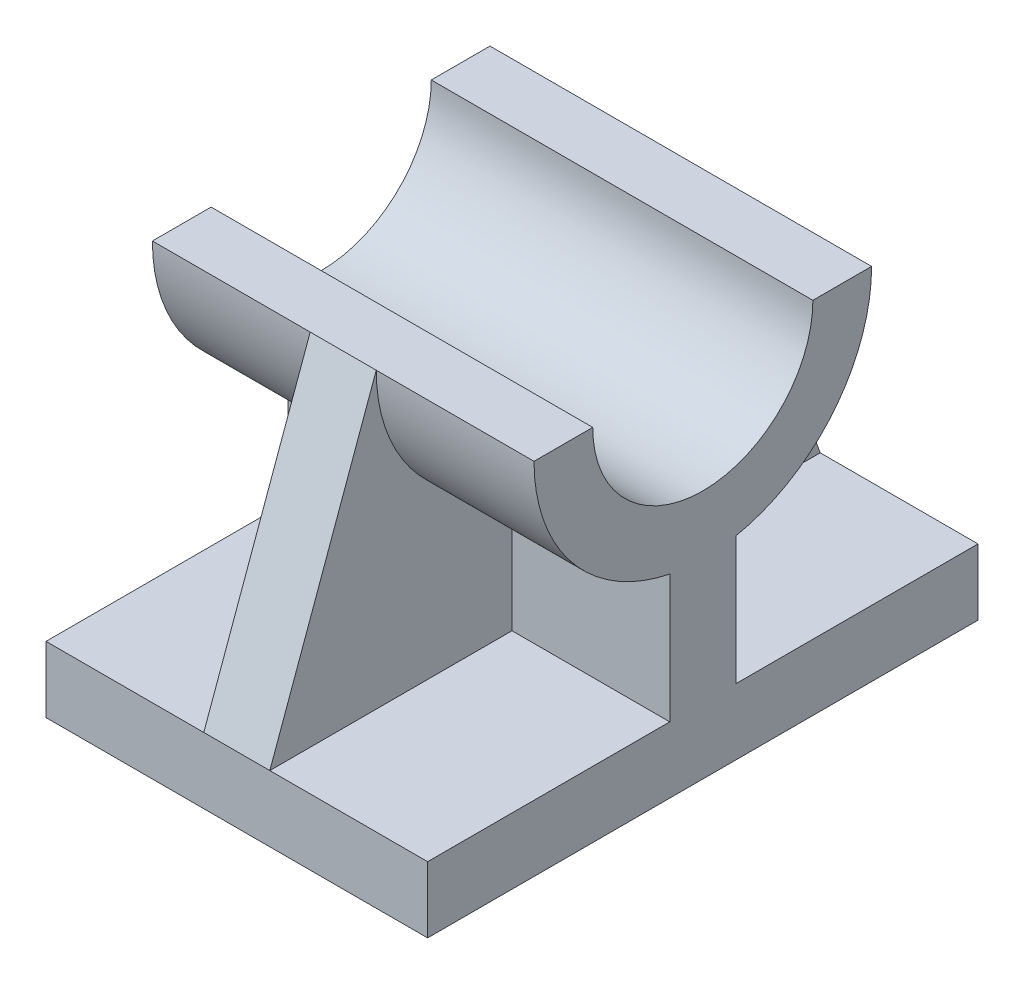
ISO-10303-21;
HEADER;
FILE_DESCRIPTION(('STEP AP214'),'2;1');
FILE_NAME('part.step','',(''),(''),'','','');
FILE_SCHEMA(('AUTOMOTIVE_DESIGN { 1 0 10303 214 1 1 1 1 }'));
ENDSEC;
DATA;
#1=APPLICATION_CONTEXT('core data for automotive mechanical design processes');
#2=APPLICATION_PROTOCOL_DEFINITION('international standard','automotive_design',2000,#1);
#3=PRODUCT_CONTEXT('',#1,'mechanical');
#4=PRODUCT('Part','Part','',(#3));
#5=PRODUCT_RELATED_PRODUCT_CATEGORY('part','',(#4));
#6=PRODUCT_DEFINITION_FORMATION('','',#4);
#7=PRODUCT_DEFINITION_CONTEXT('part definition',#1,'design');
#8=PRODUCT_DEFINITION('design','',#6,#7);
#9=PRODUCT_DEFINITION_SHAPE('','',#8);
#10=(LENGTH_UNIT() NAMED_UNIT(*) SI_UNIT(.MILLI.,.METRE.));
#11=(NAMED_UNIT(*) PLANE_ANGLE_UNIT() SI_UNIT($,.RADIAN.));
#12=(NAMED_UNIT(*) SI_UNIT($,.STERADIAN.) SOLID_ANGLE_UNIT());
#13=UNCERTAINTY_MEASURE_WITH_UNIT(LENGTH_MEASURE(1.E-05),#10,'distance_accuracy_value','');
#14=(GEOMETRIC_REPRESENTATION_CONTEXT(3) GLOBAL_UNCERTAINTY_ASSIGNED_CONTEXT((#13)) GLOBAL_UNIT_ASSIGNED_CONTEXT((#10,
#11,#12)) REPRESENTATION_CONTEXT('',''));
#15=CARTESIAN_POINT('',(0.,0.,0.));
#16=DIRECTION('',(0.,0.,1.));
#17=DIRECTION('',(1.,0.,0.));
#18=AXIS2_PLACEMENT_3D('',#15,#16,#17);
#19=CARTESIAN_POINT('',(26.,44.5,0.));
#20=DIRECTION('',(-1.,0.,0.));
#21=DIRECTION('',(0.,0.,1.));
#22=AXIS2_PLACEMENT_3D('',#19,#20,#21);
#23=CYLINDRICAL_SURFACE('',#22,23.);
#24=CARTESIAN_POINT('',(-4.5,44.5,0.));
#25=DIRECTION('',(1.,0.,0.));
#26=DIRECTION('',(0.,0.,-1.));
#27=AXIS2_PLACEMENT_3D('',#24,#25,#26);
#28=CIRCLE('',#27,23.);
#29=CARTESIAN_POINT('',(-4.5,44.5,23.));
#30=VERTEX_POINT('',#29);
#31=CARTESIAN_POINT('',(-4.5,21.9445128627201,4.5));
#32=VERTEX_POINT('',#31);
#33=EDGE_CURVE('E192',#30,#32,#28,.T.);
#34=ORIENTED_EDGE('',*,*,#33,.F.);
#35=DIRECTION('',(-1.,0.,0.));
#36=VECTOR('',#35,1.);
#37=CARTESIAN_POINT('',(26.,44.5,23.));
#38=LINE('',#37,#36);
#39=CARTESIAN_POINT('',(-26.,44.5,23.));
#40=VERTEX_POINT('',#39);
#41=EDGE_CURVE('E202',#30,#40,#38,.T.);
#42=ORIENTED_EDGE('',*,*,#41,.T.);
#43=CARTESIAN_POINT('',(-26.,44.5,0.));
#44=DIRECTION('',(1.,0.,0.));
#45=DIRECTION('',(0.,0.,-1.));
#46=AXIS2_PLACEMENT_3D('',#43,#44,#45);
#47=CIRCLE('',#46,23.);
#48=CARTESIAN_POINT('',(-26.,21.9445128627201,4.5));
#49=VERTEX_POINT('',#48);
#50=EDGE_CURVE('E276',#40,#49,#47,.T.);
#51=ORIENTED_EDGE('',*,*,#50,.T.);
#52=DIRECTION('',(-1.,0.,0.));
#53=VECTOR('',#52,1.);
#54=CARTESIAN_POINT('',(26.,21.9445128627201,4.5));
#55=LINE('',#54,#53);
#56=EDGE_CURVE('E204',#32,#49,#55,.T.);
#57=ORIENTED_EDGE('',*,*,#56,.F.);
#58=EDGE_LOOP('',(#34,#42,#51,#57));
#59=FACE_BOUND('',#58,.T.);
#60=ADVANCED_FACE('F39',(#59),#23,.T.);
#61=CARTESIAN_POINT('',(26.,21.9445128627201,4.5));
#62=DIRECTION('',(0.,0.,-1.));
#63=DIRECTION('',(-1.,0.,0.));
#64=AXIS2_PLACEMENT_3D('',#61,#62,#63);
#65=PLANE('',#64);
#66=DIRECTION('',(0.,-1.,0.));
#67=VECTOR('',#66,1.);
#68=CARTESIAN_POINT('',(-4.5,21.9445128627201,4.5));
#69=LINE('',#68,#67);
#70=CARTESIAN_POINT('',(-4.5,4.5,4.5));
#71=VERTEX_POINT('',#70);
#72=EDGE_CURVE('E206',#32,#71,#69,.T.);
#73=ORIENTED_EDGE('',*,*,#72,.F.);
#74=ORIENTED_EDGE('',*,*,#56,.T.);
#75=DIRECTION('',(0.,-1.,0.));
#76=VECTOR('',#75,1.);
#77=CARTESIAN_POINT('',(-26.,21.9445128627201,4.5));
#78=LINE('',#77,#76);
#79=CARTESIAN_POINT('',(-26.,4.5,4.5));
#80=VERTEX_POINT('',#79);
#81=EDGE_CURVE('E279',#49,#80,#78,.T.);
#82=ORIENTED_EDGE('',*,*,#81,.T.);
#83=DIRECTION('',(-1.,0.,0.));
#84=VECTOR('',#83,1.);
#85=CARTESIAN_POINT('',(26.,4.5,4.5));
#86=LINE('',#85,#84);
#87=EDGE_CURVE('E316',#71,#80,#86,.T.);
#88=ORIENTED_EDGE('',*,*,#87,.F.);
#89=EDGE_LOOP('',(#73,#74,#82,#88));
#90=FACE_BOUND('',#89,.T.);
#91=ADVANCED_FACE('F334',(#90),#65,.F.);
#92=CARTESIAN_POINT('',(26.,4.5,37.5));
#93=DIRECTION('',(0.,-1.,0.));
#94=DIRECTION('',(0.,0.,-1.));
#95=AXIS2_PLACEMENT_3D('',#92,#93,#94);
#96=PLANE('',#95);
#97=DIRECTION('',(0.,0.,1.));
#98=VECTOR('',#97,1.);
#99=CARTESIAN_POINT('',(-4.5,4.5,37.5));
#100=LINE('',#99,#98);
#101=CARTESIAN_POINT('',(-4.49999999999999,4.5,37.5));
#102=VERTEX_POINT('',#101);
#103=EDGE_CURVE('E195',#71,#102,#100,.T.);
#104=ORIENTED_EDGE('',*,*,#103,.F.);
#105=ORIENTED_EDGE('',*,*,#87,.T.);
#106=DIRECTION('',(0.,0.,1.));
#107=VECTOR('',#106,1.);
#108=CARTESIAN_POINT('',(-26.,4.5,37.5));
#109=LINE('',#108,#107);
#110=CARTESIAN_POINT('',(-26.,4.5,37.5));
#111=VERTEX_POINT('',#110);
#112=EDGE_CURVE('E283',#80,#111,#109,.T.);
#113=ORIENTED_EDGE('',*,*,#112,.T.);
#114=DIRECTION('',(-1.,0.,0.));
#115=VECTOR('',#114,1.);
#116=CARTESIAN_POINT('',(26.,4.5,37.5));
#117=LINE('',#116,#115);
#118=EDGE_CURVE('E312',#102,#111,#117,.T.);
#119=ORIENTED_EDGE('',*,*,#118,.F.);
#120=EDGE_LOOP('',(#104,#105,#113,#119));
#121=FACE_BOUND('',#120,.T.);
#122=ADVANCED_FACE('F329',(#121),#96,.F.);
#123=CARTESIAN_POINT('',(26.,4.5,-4.5));
#124=DIRECTION('',(0.,-1.,0.));
#125=DIRECTION('',(0.,0.,-1.));
#126=AXIS2_PLACEMENT_3D('',#123,#124,#125);
#127=PLANE('',#126);
#128=DIRECTION('',(0.,0.,1.));
#129=VECTOR('',#128,1.);
#130=CARTESIAN_POINT('',(-4.5,4.5,-4.5));
#131=LINE('',#130,#129);
#132=CARTESIAN_POINT('',(-4.5,4.5,-37.5));
#133=VERTEX_POINT('',#132);
#134=CARTESIAN_POINT('',(-4.49999999999999,4.5,-4.5));
#135=VERTEX_POINT('',#134);
#136=EDGE_CURVE('E410',#133,#135,#131,.T.);
#137=ORIENTED_EDGE('',*,*,#136,.F.);
#138=DIRECTION('',(-1.,0.,0.));
#139=VECTOR('',#138,1.);
#140=CARTESIAN_POINT('',(26.,4.5,-37.5));
#141=LINE('',#140,#139);
#142=CARTESIAN_POINT('',(-26.,4.5,-37.5));
#143=VERTEX_POINT('',#142);
#144=EDGE_CURVE('E306',#133,#143,#141,.T.);
#145=ORIENTED_EDGE('',*,*,#144,.T.);
#146=DIRECTION('',(0.,0.,1.));
#147=VECTOR('',#146,1.);
#148=CARTESIAN_POINT('',(-26.,4.5,-4.5));
#149=LINE('',#148,#147);
#150=CARTESIAN_POINT('',(-26.,4.5,-4.5));
#151=VERTEX_POINT('',#150);
#152=EDGE_CURVE('E258',#143,#151,#149,.T.);
#153=ORIENTED_EDGE('',*,*,#152,.T.);
#154=DIRECTION('',(-1.,0.,0.));
#155=VECTOR('',#154,1.);
#156=CARTESIAN_POINT('',(26.,4.5,-4.5));
#157=LINE('',#156,#155);
#158=EDGE_CURVE('E48',#135,#151,#157,.T.);
#159=ORIENTED_EDGE('',*,*,#158,.F.);
#160=EDGE_LOOP('',(#137,#145,#153,#159));
#161=FACE_BOUND('',#160,.T.);
#162=ADVANCED_FACE('F517',(#161),#127,.F.);
#163=CARTESIAN_POINT('',(26.,21.9445128627201,-4.5));
#164=DIRECTION('',(0.,0.,1.));
#165=DIRECTION('',(0.,-1.,0.));
#166=AXIS2_PLACEMENT_3D('',#163,#164,#165);
#167=PLANE('',#166);
#168=DIRECTION('',(0.,1.,0.));
#169=VECTOR('',#168,1.);
#170=CARTESIAN_POINT('',(-4.5,21.9445128627201,-4.5));
#171=LINE('',#170,#169);
#172=CARTESIAN_POINT('',(-4.49999999999999,21.9445128627201,-4.49999999999999));
#173=VERTEX_POINT('',#172);
#174=EDGE_CURVE('E63',#135,#173,#171,.T.);
#175=ORIENTED_EDGE('',*,*,#174,.F.);
#176=ORIENTED_EDGE('',*,*,#158,.T.);
#177=DIRECTION('',(0.,1.,0.));
#178=VECTOR('',#177,1.);
#179=CARTESIAN_POINT('',(-26.,21.9445128627201,-4.5));
#180=LINE('',#179,#178);
#181=CARTESIAN_POINT('',(-26.,21.9445128627201,-4.49999999999999));
#182=VERTEX_POINT('',#181);
#183=EDGE_CURVE('E252',#151,#182,#180,.T.);
#184=ORIENTED_EDGE('',*,*,#183,.T.);
#185=DIRECTION('',(-1.,0.,0.));
#186=VECTOR('',#185,1.);
#187=CARTESIAN_POINT('',(26.,21.9445128627201,-4.49999999999999));
#188=LINE('',#187,#186);
#189=EDGE_CURVE('E232',#173,#182,#188,.T.);
#190=ORIENTED_EDGE('',*,*,#189,.F.);
#191=EDGE_LOOP('',(#175,#176,#184,#190));
#192=FACE_BOUND('',#191,.T.);
#193=ADVANCED_FACE('F253',(#192),#167,.F.);
#194=CARTESIAN_POINT('',(26.,44.5,0.));
#195=DIRECTION('',(-1.,0.,0.));
#196=DIRECTION('',(0.,0.,1.));
#197=AXIS2_PLACEMENT_3D('',#194,#195,#196);
#198=CYLINDRICAL_SURFACE('',#197,23.);
#199=CARTESIAN_POINT('',(-4.5,44.5,0.));
#200=DIRECTION('',(1.,0.,0.));
#201=DIRECTION('',(0.,0.,-1.));
#202=AXIS2_PLACEMENT_3D('',#199,#200,#201);
#203=CIRCLE('',#202,23.);
#204=CARTESIAN_POINT('',(-4.49999999999999,44.5,-23.));
#205=VERTEX_POINT('',#204);
#206=EDGE_CURVE('E250',#173,#205,#203,.T.);
#207=ORIENTED_EDGE('',*,*,#206,.F.);
#208=ORIENTED_EDGE('',*,*,#189,.T.);
#209=CARTESIAN_POINT('',(-26.,44.5,0.));
#210=DIRECTION('',(1.,0.,0.));
#211=DIRECTION('',(0.,0.,-1.));
#212=AXIS2_PLACEMENT_3D('',#209,#210,#211);
#213=CIRCLE('',#212,23.);
#214=CARTESIAN_POINT('',(-26.,44.5,-23.));
#215=VERTEX_POINT('',#214);
#216=EDGE_CURVE('E247',#182,#215,#213,.T.);
#217=ORIENTED_EDGE('',*,*,#216,.T.);
#218=DIRECTION('',(-1.,0.,0.));
#219=VECTOR('',#218,1.);
#220=CARTESIAN_POINT('',(26.,44.5,-23.));
#221=LINE('',#220,#219);
#222=EDGE_CURVE('E228',#205,#215,#221,.T.);
#223=ORIENTED_EDGE('',*,*,#222,.F.);
#224=EDGE_LOOP('',(#207,#208,#217,#223));
#225=FACE_BOUND('',#224,.T.);
#226=ADVANCED_FACE('F245',(#225),#198,.T.);
#227=CARTESIAN_POINT('',(26.,4.5,-37.5));
#228=VERTEX_POINT('',#227);
#229=CARTESIAN_POINT('',(4.50000000000001,4.5,-37.5));
#230=VERTEX_POINT('',#229);
#231=EDGE_CURVE('E300',#228,#230,#141,.T.);
#232=ORIENTED_EDGE('',*,*,#231,.T.);
#233=DIRECTION('',(0.,0.,1.));
#234=VECTOR('',#233,1.);
#235=CARTESIAN_POINT('',(4.5,4.5,-4.5));
#236=LINE('',#235,#234);
#237=CARTESIAN_POINT('',(4.50000000000001,4.5,-4.5));
#238=VERTEX_POINT('',#237);
#239=EDGE_CURVE('E394',#230,#238,#236,.T.);
#240=ORIENTED_EDGE('',*,*,#239,.T.);
#241=CARTESIAN_POINT('',(26.,4.5,-4.5));
#242=VERTEX_POINT('',#241);
#243=EDGE_CURVE('E11',#242,#238,#157,.T.);
#244=ORIENTED_EDGE('',*,*,#243,.F.);
#245=DIRECTION('',(0.,0.,1.));
#246=VECTOR('',#245,1.);
#247=CARTESIAN_POINT('',(26.,4.5,-4.5));
#248=LINE('',#247,#246);
#249=EDGE_CURVE('E299',#228,#242,#248,.T.);
#250=ORIENTED_EDGE('',*,*,#249,.F.);
#251=EDGE_LOOP('',(#232,#240,#244,#250));
#252=FACE_BOUND('',#251,.T.);
#253=ADVANCED_FACE('F41',(#252),#127,.F.);
#254=ORIENTED_EDGE('',*,*,#243,.T.);
#255=DIRECTION('',(0.,1.,0.));
#256=VECTOR('',#255,1.);
#257=CARTESIAN_POINT('',(4.5,21.9445128627201,-4.5));
#258=LINE('',#257,#256);
#259=CARTESIAN_POINT('',(4.50000000000001,21.9445128627201,-4.49999999999999));
#260=VERTEX_POINT('',#259);
#261=EDGE_CURVE('E401',#238,#260,#258,.T.);
#262=ORIENTED_EDGE('',*,*,#261,.T.);
#263=CARTESIAN_POINT('',(26.,21.9445128627201,-4.49999999999999));
#264=VERTEX_POINT('',#263);
#265=EDGE_CURVE('E233',#264,#260,#188,.T.);
#266=ORIENTED_EDGE('',*,*,#265,.F.);
#267=DIRECTION('',(0.,1.,0.));
#268=VECTOR('',#267,1.);
#269=CARTESIAN_POINT('',(26.,21.9445128627201,-4.5));
#270=LINE('',#269,#268);
#271=EDGE_CURVE('E378',#242,#264,#270,.T.);
#272=ORIENTED_EDGE('',*,*,#271,.F.);
#273=EDGE_LOOP('',(#254,#262,#266,#272));
#274=FACE_BOUND('',#273,.T.);
#275=ADVANCED_FACE('F475',(#274),#167,.F.);
#276=ORIENTED_EDGE('',*,*,#265,.T.);
#277=CARTESIAN_POINT('',(4.5,44.5,0.));
#278=DIRECTION('',(1.,0.,0.));
#279=DIRECTION('',(0.,0.,-1.));
#280=AXIS2_PLACEMENT_3D('',#277,#278,#279);
#281=CIRCLE('',#280,23.);
#282=CARTESIAN_POINT('',(4.50000000000001,44.5,-23.));
#283=VERTEX_POINT('',#282);
#284=EDGE_CURVE('E405',#260,#283,#281,.T.);
#285=ORIENTED_EDGE('',*,*,#284,.T.);
#286=CARTESIAN_POINT('',(26.,44.5,-23.));
#287=VERTEX_POINT('',#286);
#288=EDGE_CURVE('E229',#287,#283,#221,.T.);
#289=ORIENTED_EDGE('',*,*,#288,.F.);
#290=CARTESIAN_POINT('',(26.,44.5,0.));
#291=DIRECTION('',(1.,0.,0.));
#292=DIRECTION('',(0.,0.,-1.));
#293=AXIS2_PLACEMENT_3D('',#290,#291,#292);
#294=CIRCLE('',#293,23.);
#295=EDGE_CURVE('E375',#264,#287,#294,.T.);
#296=ORIENTED_EDGE('',*,*,#295,.F.);
#297=EDGE_LOOP('',(#276,#285,#289,#296));
#298=FACE_BOUND('',#297,.T.);
#299=ADVANCED_FACE('F476',(#298),#198,.T.);
#300=CARTESIAN_POINT('',(26.,44.5,-15.));
#301=DIRECTION('',(0.,-1.,0.));
#302=DIRECTION('',(0.,0.,-1.));
#303=AXIS2_PLACEMENT_3D('',#300,#301,#302);
#304=PLANE('',#303);
#305=ORIENTED_EDGE('',*,*,#288,.T.);
#306=DIRECTION('',(-1.,0.,0.));
#307=VECTOR('',#306,1.);
#308=CARTESIAN_POINT('',(26.,44.5,-23.));
#309=LINE('',#308,#307);
#310=EDGE_CURVE('E388',#205,#283,#309,.F.);
#311=ORIENTED_EDGE('',*,*,#310,.F.);
#312=ORIENTED_EDGE('',*,*,#222,.T.);
#313=DIRECTION('',(0.,0.,1.));
#314=VECTOR('',#313,1.);
#315=CARTESIAN_POINT('',(-26.,44.5,-15.));
#316=LINE('',#315,#314);
#317=CARTESIAN_POINT('',(-26.,44.5,-15.));
#318=VERTEX_POINT('',#317);
#319=EDGE_CURVE('E263',#215,#318,#316,.T.);
#320=ORIENTED_EDGE('',*,*,#319,.T.);
#321=DIRECTION('',(-1.,0.,0.));
#322=VECTOR('',#321,1.);
#323=CARTESIAN_POINT('',(26.,44.5,-15.));
#324=LINE('',#323,#322);
#325=CARTESIAN_POINT('',(26.,44.5,-15.));
#326=VERTEX_POINT('',#325);
#327=EDGE_CURVE('E225',#326,#318,#324,.T.);
#328=ORIENTED_EDGE('',*,*,#327,.F.);
#329=DIRECTION('',(0.,0.,1.));
#330=VECTOR('',#329,1.);
#331=CARTESIAN_POINT('',(26.,44.5,-15.));
#332=LINE('',#331,#330);
#333=EDGE_CURVE('E372',#287,#326,#332,.T.);
#334=ORIENTED_EDGE('',*,*,#333,.F.);
#335=EDGE_LOOP('',(#305,#311,#312,#320,#328,#334));
#336=FACE_BOUND('',#335,.T.);
#337=ADVANCED_FACE('F460',(#336),#304,.F.);
#338=CARTESIAN_POINT('',(26.,44.5,0.));
#339=DIRECTION('',(-1.,0.,0.));
#340=DIRECTION('',(0.,0.,1.));
#341=AXIS2_PLACEMENT_3D('',#338,#339,#340);
#342=CYLINDRICAL_SURFACE('',#341,15.);
#343=ORIENTED_EDGE('',*,*,#327,.T.);
#344=CARTESIAN_POINT('',(-26.,44.5,0.));
#345=DIRECTION('',(-1.,0.,0.));
#346=DIRECTION('',(0.,0.,-1.));
#347=AXIS2_PLACEMENT_3D('',#344,#345,#346);
#348=CIRCLE('',#347,15.);
#349=CARTESIAN_POINT('',(-26.,44.5,15.));
#350=VERTEX_POINT('',#349);
#351=EDGE_CURVE('E267',#318,#350,#348,.T.);
#352=ORIENTED_EDGE('',*,*,#351,.T.);
#353=DIRECTION('',(-1.,0.,0.));
#354=VECTOR('',#353,1.);
#355=CARTESIAN_POINT('',(26.,44.5,15.));
#356=LINE('',#355,#354);
#357=CARTESIAN_POINT('',(26.,44.5,15.));
#358=VERTEX_POINT('',#357);
#359=EDGE_CURVE('E218',#358,#350,#356,.T.);
#360=ORIENTED_EDGE('',*,*,#359,.F.);
#361=CARTESIAN_POINT('',(26.,44.5,0.));
#362=DIRECTION('',(-1.,0.,0.));
#363=DIRECTION('',(0.,0.,-1.));
#364=AXIS2_PLACEMENT_3D('',#361,#362,#363);
#365=CIRCLE('',#364,15.);
#366=EDGE_CURVE('E369',#326,#358,#365,.T.);
#367=ORIENTED_EDGE('',*,*,#366,.F.);
#368=EDGE_LOOP('',(#343,#352,#360,#367));
#369=FACE_BOUND('',#368,.T.);
#370=ADVANCED_FACE('F458',(#369),#342,.F.);
#371=CARTESIAN_POINT('',(26.,44.5,23.));
#372=DIRECTION('',(0.,-1.,0.));
#373=DIRECTION('',(0.,0.,-1.));
#374=AXIS2_PLACEMENT_3D('',#371,#372,#373);
#375=PLANE('',#374);
#376=ORIENTED_EDGE('',*,*,#359,.T.);
#377=DIRECTION('',(0.,0.,1.));
#378=VECTOR('',#377,1.);
#379=CARTESIAN_POINT('',(-26.,44.5,23.));
#380=LINE('',#379,#378);
#381=EDGE_CURVE('E210',#350,#40,#380,.T.);
#382=ORIENTED_EDGE('',*,*,#381,.T.);
#383=ORIENTED_EDGE('',*,*,#41,.F.);
#384=DIRECTION('',(-1.,0.,0.));
#385=VECTOR('',#384,1.);
#386=CARTESIAN_POINT('',(26.,44.5,23.));
#387=LINE('',#386,#385);
#388=CARTESIAN_POINT('',(4.5,44.5,23.));
#389=VERTEX_POINT('',#388);
#390=EDGE_CURVE('E177',#30,#389,#387,.F.);
#391=ORIENTED_EDGE('',*,*,#390,.T.);
#392=CARTESIAN_POINT('',(26.,44.5,23.));
#393=VERTEX_POINT('',#392);
#394=EDGE_CURVE('E213',#393,#389,#38,.T.);
#395=ORIENTED_EDGE('',*,*,#394,.F.);
#396=DIRECTION('',(0.,0.,1.));
#397=VECTOR('',#396,1.);
#398=CARTESIAN_POINT('',(26.,44.5,23.));
#399=LINE('',#398,#397);
#400=EDGE_CURVE('E366',#358,#393,#399,.T.);
#401=ORIENTED_EDGE('',*,*,#400,.F.);
#402=EDGE_LOOP('',(#376,#382,#383,#391,#395,#401));
#403=FACE_BOUND('',#402,.T.);
#404=ADVANCED_FACE('F208',(#403),#375,.F.);
#405=ORIENTED_EDGE('',*,*,#394,.T.);
#406=CARTESIAN_POINT('',(4.5,44.5,0.));
#407=DIRECTION('',(1.,0.,0.));
#408=DIRECTION('',(0.,0.,-1.));
#409=AXIS2_PLACEMENT_3D('',#406,#407,#408);
#410=CIRCLE('',#409,23.);
#411=CARTESIAN_POINT('',(4.5,21.9445128627201,4.5));
#412=VERTEX_POINT('',#411);
#413=EDGE_CURVE('E430',#389,#412,#410,.T.);
#414=ORIENTED_EDGE('',*,*,#413,.T.);
#415=CARTESIAN_POINT('',(26.,21.9445128627201,4.5));
#416=VERTEX_POINT('',#415);
#417=EDGE_CURVE('E214',#416,#412,#55,.T.);
#418=ORIENTED_EDGE('',*,*,#417,.F.);
#419=CARTESIAN_POINT('',(26.,44.5,0.));
#420=DIRECTION('',(1.,0.,0.));
#421=DIRECTION('',(0.,0.,-1.));
#422=AXIS2_PLACEMENT_3D('',#419,#420,#421);
#423=CIRCLE('',#422,23.);
#424=EDGE_CURVE('E363',#393,#416,#423,.T.);
#425=ORIENTED_EDGE('',*,*,#424,.F.);
#426=EDGE_LOOP('',(#405,#414,#418,#425));
#427=FACE_BOUND('',#426,.T.);
#428=ADVANCED_FACE('F451',(#427),#23,.T.);
#429=ORIENTED_EDGE('',*,*,#417,.T.);
#430=DIRECTION('',(0.,-1.,0.));
#431=VECTOR('',#430,1.);
#432=CARTESIAN_POINT('',(4.5,21.9445128627201,4.5));
#433=LINE('',#432,#431);
#434=CARTESIAN_POINT('',(4.5,4.5,4.5));
#435=VERTEX_POINT('',#434);
#436=EDGE_CURVE('E426',#412,#435,#433,.T.);
#437=ORIENTED_EDGE('',*,*,#436,.T.);
#438=CARTESIAN_POINT('',(26.,4.5,4.5));
#439=VERTEX_POINT('',#438);
#440=EDGE_CURVE('E318',#439,#435,#86,.T.);
#441=ORIENTED_EDGE('',*,*,#440,.F.);
#442=DIRECTION('',(0.,-1.,0.));
#443=VECTOR('',#442,1.);
#444=CARTESIAN_POINT('',(26.,21.9445128627201,4.5));
#445=LINE('',#444,#443);
#446=EDGE_CURVE('E360',#416,#439,#445,.T.);
#447=ORIENTED_EDGE('',*,*,#446,.F.);
#448=EDGE_LOOP('',(#429,#437,#441,#447));
#449=FACE_BOUND('',#448,.T.);
#450=ADVANCED_FACE('F449',(#449),#65,.F.);
#451=ORIENTED_EDGE('',*,*,#440,.T.);
#452=DIRECTION('',(0.,0.,1.));
#453=VECTOR('',#452,1.);
#454=CARTESIAN_POINT('',(4.5,4.5,37.5));
#455=LINE('',#454,#453);
#456=CARTESIAN_POINT('',(4.5,4.50000000000011,37.5));
#457=VERTEX_POINT('',#456);
#458=EDGE_CURVE('E187',#435,#457,#455,.T.);
#459=ORIENTED_EDGE('',*,*,#458,.T.);
#460=CARTESIAN_POINT('',(26.,4.5,37.5));
#461=VERTEX_POINT('',#460);
#462=EDGE_CURVE('E313',#461,#457,#117,.T.);
#463=ORIENTED_EDGE('',*,*,#462,.F.);
#464=DIRECTION('',(0.,0.,1.));
#465=VECTOR('',#464,1.);
#466=CARTESIAN_POINT('',(26.,4.5,37.5));
#467=LINE('',#466,#465);
#468=EDGE_CURVE('E357',#439,#461,#467,.T.);
#469=ORIENTED_EDGE('',*,*,#468,.F.);
#470=EDGE_LOOP('',(#451,#459,#463,#469));
#471=FACE_BOUND('',#470,.T.);
#472=ADVANCED_FACE('F442',(#471),#96,.F.);
#473=CARTESIAN_POINT('',(26.,-4.5,37.5));
#474=DIRECTION('',(0.,0.,-1.));
#475=DIRECTION('',(-1.,0.,0.));
#476=AXIS2_PLACEMENT_3D('',#473,#474,#475);
#477=PLANE('',#476);
#478=ORIENTED_EDGE('',*,*,#462,.T.);
#479=EDGE_CURVE('E317',#457,#102,#117,.T.);
#480=ORIENTED_EDGE('',*,*,#479,.T.);
#481=ORIENTED_EDGE('',*,*,#118,.T.);
#482=DIRECTION('',(0.,-1.,0.));
#483=VECTOR('',#482,1.);
#484=CARTESIAN_POINT('',(-26.,-4.5,37.5));
#485=LINE('',#484,#483);
#486=CARTESIAN_POINT('',(-26.,-4.5,37.5));
#487=VERTEX_POINT('',#486);
#488=EDGE_CURVE('E287',#111,#487,#485,.T.);
#489=ORIENTED_EDGE('',*,*,#488,.T.);
#490=DIRECTION('',(-1.,0.,0.));
#491=VECTOR('',#490,1.);
#492=CARTESIAN_POINT('',(26.,-4.5,37.5));
#493=LINE('',#492,#491);
#494=CARTESIAN_POINT('',(26.,-4.5,37.5));
#495=VERTEX_POINT('',#494);
#496=EDGE_CURVE('E309',#495,#487,#493,.T.);
#497=ORIENTED_EDGE('',*,*,#496,.F.);
#498=DIRECTION('',(0.,-1.,0.));
#499=VECTOR('',#498,1.);
#500=CARTESIAN_POINT('',(26.,-4.5,37.5));
#501=LINE('',#500,#499);
#502=EDGE_CURVE('E354',#461,#495,#501,.T.);
#503=ORIENTED_EDGE('',*,*,#502,.F.);
#504=EDGE_LOOP('',(#478,#480,#481,#489,#497,#503));
#505=FACE_BOUND('',#504,.T.);
#506=ADVANCED_FACE('F339',(#505),#477,.F.);
#507=CARTESIAN_POINT('',(26.,-4.5,37.5));
#508=DIRECTION('',(0.,1.,0.));
#509=DIRECTION('',(0.,0.,1.));
#510=AXIS2_PLACEMENT_3D('',#507,#508,#509);
#511=PLANE('',#510);
#512=ORIENTED_EDGE('',*,*,#496,.T.);
#513=DIRECTION('',(0.,0.,-1.));
#514=VECTOR('',#513,1.);
#515=CARTESIAN_POINT('',(-26.,-4.5,37.5));
#516=LINE('',#515,#514);
#517=CARTESIAN_POINT('',(-26.,-4.5,-37.5));
#518=VERTEX_POINT('',#517);
#519=EDGE_CURVE('E291',#487,#518,#516,.T.);
#520=ORIENTED_EDGE('',*,*,#519,.T.);
#521=DIRECTION('',(-1.,0.,0.));
#522=VECTOR('',#521,1.);
#523=CARTESIAN_POINT('',(26.,-4.5,-37.5));
#524=LINE('',#523,#522);
#525=CARTESIAN_POINT('',(26.,-4.5,-37.5));
#526=VERTEX_POINT('',#525);
#527=EDGE_CURVE('E304',#526,#518,#524,.T.);
#528=ORIENTED_EDGE('',*,*,#527,.F.);
#529=DIRECTION('',(0.,0.,-1.));
#530=VECTOR('',#529,1.);
#531=CARTESIAN_POINT('',(26.,-4.5,37.5));
#532=LINE('',#531,#530);
#533=EDGE_CURVE('E351',#495,#526,#532,.T.);
#534=ORIENTED_EDGE('',*,*,#533,.F.);
#535=EDGE_LOOP('',(#512,#520,#528,#534));
#536=FACE_BOUND('',#535,.T.);
#537=ADVANCED_FACE('F615',(#536),#511,.F.);
#538=CARTESIAN_POINT('',(26.,-4.5,-37.5));
#539=DIRECTION('',(0.,0.,1.));
#540=DIRECTION('',(1.,0.,0.));
#541=AXIS2_PLACEMENT_3D('',#538,#539,#540);
#542=PLANE('',#541);
#543=ORIENTED_EDGE('',*,*,#527,.T.);
#544=DIRECTION('',(0.,1.,0.));
#545=VECTOR('',#544,1.);
#546=CARTESIAN_POINT('',(-26.,-4.5,-37.5));
#547=LINE('',#546,#545);
#548=EDGE_CURVE('E295',#518,#143,#547,.T.);
#549=ORIENTED_EDGE('',*,*,#548,.T.);
#550=ORIENTED_EDGE('',*,*,#144,.F.);
#551=EDGE_CURVE('E305',#230,#133,#141,.T.);
#552=ORIENTED_EDGE('',*,*,#551,.F.);
#553=ORIENTED_EDGE('',*,*,#231,.F.);
#554=DIRECTION('',(0.,1.,0.));
#555=VECTOR('',#554,1.);
#556=CARTESIAN_POINT('',(26.,-4.5,-37.5));
#557=LINE('',#556,#555);
#558=EDGE_CURVE('E349',#526,#228,#557,.T.);
#559=ORIENTED_EDGE('',*,*,#558,.F.);
#560=EDGE_LOOP('',(#543,#549,#550,#552,#553,#559));
#561=FACE_BOUND('',#560,.T.);
#562=ADVANCED_FACE('F468',(#561),#542,.F.);
#563=CARTESIAN_POINT('',(26.,44.5,0.));
#564=DIRECTION('',(1.,0.,0.));
#565=DIRECTION('',(0.,0.,-1.));
#566=AXIS2_PLACEMENT_3D('',#563,#564,#565);
#567=PLANE('',#566);
#568=ORIENTED_EDGE('',*,*,#249,.T.);
#569=ORIENTED_EDGE('',*,*,#271,.T.);
#570=ORIENTED_EDGE('',*,*,#295,.T.);
#571=ORIENTED_EDGE('',*,*,#333,.T.);
#572=ORIENTED_EDGE('',*,*,#366,.T.);
#573=ORIENTED_EDGE('',*,*,#400,.T.);
#574=ORIENTED_EDGE('',*,*,#424,.T.);
#575=ORIENTED_EDGE('',*,*,#446,.T.);
#576=ORIENTED_EDGE('',*,*,#468,.T.);
#577=ORIENTED_EDGE('',*,*,#502,.T.);
#578=ORIENTED_EDGE('',*,*,#533,.T.);
#579=ORIENTED_EDGE('',*,*,#558,.T.);
#580=EDGE_LOOP('',(#568,#569,#570,#571,#572,#573,#574,#575,#576,#577,#578,#579));
#581=FACE_BOUND('',#580,.T.);
#582=ADVANCED_FACE('F443',(#581),#567,.T.);
#583=CARTESIAN_POINT('',(-26.,44.5,0.));
#584=DIRECTION('',(1.,0.,0.));
#585=DIRECTION('',(0.,0.,-1.));
#586=AXIS2_PLACEMENT_3D('',#583,#584,#585);
#587=PLANE('',#586);
#588=ORIENTED_EDGE('',*,*,#152,.F.);
#589=ORIENTED_EDGE('',*,*,#548,.F.);
#590=ORIENTED_EDGE('',*,*,#519,.F.);
#591=ORIENTED_EDGE('',*,*,#488,.F.);
#592=ORIENTED_EDGE('',*,*,#112,.F.);
#593=ORIENTED_EDGE('',*,*,#81,.F.);
#594=ORIENTED_EDGE('',*,*,#50,.F.);
#595=ORIENTED_EDGE('',*,*,#381,.F.);
#596=ORIENTED_EDGE('',*,*,#351,.F.);
#597=ORIENTED_EDGE('',*,*,#319,.F.);
#598=ORIENTED_EDGE('',*,*,#216,.F.);
#599=ORIENTED_EDGE('',*,*,#183,.F.);
#600=EDGE_LOOP('',(#588,#589,#590,#591,#592,#593,#594,#595,#596,#597,#598,#599));
#601=FACE_BOUND('',#600,.T.);
#602=ADVANCED_FACE('F260',(#601),#587,.F.);
#603=CARTESIAN_POINT('',(4.5,20.,0.));
#604=DIRECTION('',(1.,0.,0.));
#605=DIRECTION('',(0.,0.,-1.));
#606=AXIS2_PLACEMENT_3D('',#603,#604,#605);
#607=PLANE('',#606);
#608=ORIENTED_EDGE('',*,*,#239,.F.);
#609=DIRECTION('',(0.,-0.940136065162483,-0.3407993236214));
#610=VECTOR('',#609,1.);
#611=CARTESIAN_POINT('',(4.5,44.5,-23.));
#612=LINE('',#611,#610);
#613=EDGE_CURVE('E418',#283,#230,#612,.T.);
#614=ORIENTED_EDGE('',*,*,#613,.F.);
#615=ORIENTED_EDGE('',*,*,#284,.F.);
#616=ORIENTED_EDGE('',*,*,#261,.F.);
#617=EDGE_LOOP('',(#608,#614,#615,#616));
#618=FACE_BOUND('',#617,.T.);
#619=ADVANCED_FACE('F473',(#618),#607,.T.);
#620=CARTESIAN_POINT('',(-4.5,20.,0.));
#621=DIRECTION('',(1.,0.,0.));
#622=DIRECTION('',(0.,0.,-1.));
#623=AXIS2_PLACEMENT_3D('',#620,#621,#622);
#624=PLANE('',#623);
#625=DIRECTION('',(0.,-0.940136065162483,-0.3407993236214));
#626=VECTOR('',#625,1.);
#627=CARTESIAN_POINT('',(-4.5,44.5,-23.));
#628=LINE('',#627,#626);
#629=EDGE_CURVE('E186',#205,#133,#628,.T.);
#630=ORIENTED_EDGE('',*,*,#629,.T.);
#631=ORIENTED_EDGE('',*,*,#136,.T.);
#632=ORIENTED_EDGE('',*,*,#174,.T.);
#633=ORIENTED_EDGE('',*,*,#206,.T.);
#634=EDGE_LOOP('',(#630,#631,#632,#633));
#635=FACE_BOUND('',#634,.T.);
#636=ADVANCED_FACE('F464',(#635),#624,.F.);
#637=CARTESIAN_POINT('',(0.,44.5,-23.));
#638=DIRECTION('',(0.,-0.3407993236214,0.940136065162483));
#639=DIRECTION('',(0.,-0.940136065162483,-0.3407993236214));
#640=AXIS2_PLACEMENT_3D('',#637,#638,#639);
#641=PLANE('',#640);
#642=ORIENTED_EDGE('',*,*,#629,.F.);
#643=ORIENTED_EDGE('',*,*,#310,.T.);
#644=ORIENTED_EDGE('',*,*,#613,.T.);
#645=ORIENTED_EDGE('',*,*,#551,.T.);
#646=EDGE_LOOP('',(#642,#643,#644,#645));
#647=FACE_BOUND('',#646,.T.);
#648=ADVANCED_FACE('F465',(#647),#641,.F.);
#649=CARTESIAN_POINT('',(0.,44.5,23.));
#650=DIRECTION('',(0.,0.3407993236214,0.940136065162483));
#651=DIRECTION('',(0.,-0.940136065162483,0.3407993236214));
#652=AXIS2_PLACEMENT_3D('',#649,#650,#651);
#653=PLANE('',#652);
#654=ORIENTED_EDGE('',*,*,#390,.F.);
#655=DIRECTION('',(0.,-0.940136065162483,0.3407993236214));
#656=VECTOR('',#655,1.);
#657=CARTESIAN_POINT('',(-4.5,44.5,23.));
#658=LINE('',#657,#656);
#659=EDGE_CURVE('E55',#30,#102,#658,.T.);
#660=ORIENTED_EDGE('',*,*,#659,.T.);
#661=ORIENTED_EDGE('',*,*,#479,.F.);
#662=DIRECTION('',(0.,-0.940136065162483,0.3407993236214));
#663=VECTOR('',#662,1.);
#664=CARTESIAN_POINT('',(4.5,44.5,23.));
#665=LINE('',#664,#663);
#666=EDGE_CURVE('E180',#389,#457,#665,.T.);
#667=ORIENTED_EDGE('',*,*,#666,.F.);
#668=EDGE_LOOP('',(#654,#660,#661,#667));
#669=FACE_BOUND('',#668,.T.);
#670=ADVANCED_FACE('F178',(#669),#653,.T.);
#671=CARTESIAN_POINT('',(4.5,20.,0.));
#672=DIRECTION('',(1.,0.,0.));
#673=DIRECTION('',(0.,0.,-1.));
#674=AXIS2_PLACEMENT_3D('',#671,#672,#673);
#675=PLANE('',#674);
#676=ORIENTED_EDGE('',*,*,#458,.F.);
#677=ORIENTED_EDGE('',*,*,#436,.F.);
#678=ORIENTED_EDGE('',*,*,#413,.F.);
#679=ORIENTED_EDGE('',*,*,#666,.T.);
#680=EDGE_LOOP('',(#676,#677,#678,#679));
#681=FACE_BOUND('',#680,.T.);
#682=ADVANCED_FACE('F440',(#681),#675,.T.);
#683=CARTESIAN_POINT('',(-4.5,20.,0.));
#684=DIRECTION('',(1.,0.,0.));
#685=DIRECTION('',(0.,0.,-1.));
#686=AXIS2_PLACEMENT_3D('',#683,#684,#685);
#687=PLANE('',#686);
#688=ORIENTED_EDGE('',*,*,#72,.T.);
#689=ORIENTED_EDGE('',*,*,#103,.T.);
#690=ORIENTED_EDGE('',*,*,#659,.F.);
#691=ORIENTED_EDGE('',*,*,#33,.T.);
#692=EDGE_LOOP('',(#688,#689,#690,#691));
#693=FACE_BOUND('',#692,.T.);
#694=ADVANCED_FACE('F191',(#693),#687,.F.);
#695=CLOSED_SHELL('',(#60,#91,#122,#162,#193,#226,#253,#275,#299,#337,#370,#404,#428,#450,#472,
#506,#537,#562,#582,#602,#619,#636,#648,#670,#682,#694));
#696=MANIFOLD_SOLID_BREP('B2',#695);
#697=ADVANCED_BREP_SHAPE_REPRESENTATION('',(#18,#696),#14);
#698=SHAPE_DEFINITION_REPRESENTATION(#9,#697);
ENDSEC;
END-ISO-10303-21;
